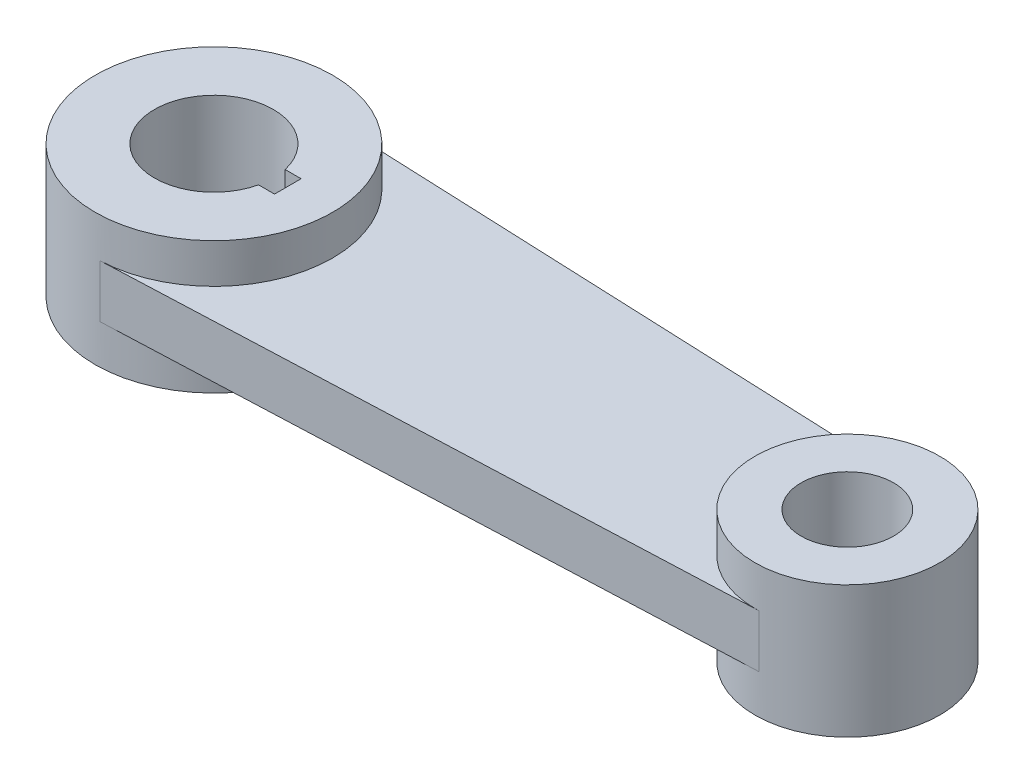
ISO-10303-21;
HEADER;
FILE_DESCRIPTION(('STEP AP214'),'2;1');
FILE_NAME('part.step','',(''),(''),'','','');
FILE_SCHEMA(('AUTOMOTIVE_DESIGN { 1 0 10303 214 1 1 1 1 }'));
ENDSEC;
DATA;
#1=APPLICATION_CONTEXT('core data for automotive mechanical design processes');
#2=APPLICATION_PROTOCOL_DEFINITION('international standard','automotive_design',2000,#1);
#3=PRODUCT_CONTEXT('',#1,'mechanical');
#4=PRODUCT('Part','Part','',(#3));
#5=PRODUCT_RELATED_PRODUCT_CATEGORY('part','',(#4));
#6=PRODUCT_DEFINITION_FORMATION('','',#4);
#7=PRODUCT_DEFINITION_CONTEXT('part definition',#1,'design');
#8=PRODUCT_DEFINITION('design','',#6,#7);
#9=PRODUCT_DEFINITION_SHAPE('','',#8);
#10=(LENGTH_UNIT() NAMED_UNIT(*) SI_UNIT(.MILLI.,.METRE.));
#11=(NAMED_UNIT(*) PLANE_ANGLE_UNIT() SI_UNIT($,.RADIAN.));
#12=(NAMED_UNIT(*) SI_UNIT($,.STERADIAN.) SOLID_ANGLE_UNIT());
#13=UNCERTAINTY_MEASURE_WITH_UNIT(LENGTH_MEASURE(1.E-05),#10,'distance_accuracy_value','');
#14=(GEOMETRIC_REPRESENTATION_CONTEXT(3) GLOBAL_UNCERTAINTY_ASSIGNED_CONTEXT((#13)) GLOBAL_UNIT_ASSIGNED_CONTEXT((#10,
#11,#12)) REPRESENTATION_CONTEXT('',''));
#15=CARTESIAN_POINT('',(0.,0.,0.));
#16=DIRECTION('',(0.,0.,1.));
#17=DIRECTION('',(1.,0.,0.));
#18=AXIS2_PLACEMENT_3D('',#15,#16,#17);
#19=CARTESIAN_POINT('',(2.34375,31.25,56.2011506638209));
#20=DIRECTION('',(-0.0416666666666667,0.,-0.999131567356817));
#21=DIRECTION('',(-0.999131567356817,0.,0.0416666666666667));
#22=AXIS2_PLACEMENT_3D('',#19,#20,#21);
#23=PLANE('',#22);
#24=DIRECTION('',(0.999131567356817,0.,-0.0416666666666667));
#25=VECTOR('',#24,1.);
#26=CARTESIAN_POINT('',(2.34375,-12.5,56.2011506638209));
#27=LINE('',#26,#25);
#28=CARTESIAN_POINT('',(2.34375,-12.5,56.2011506638209));
#29=VERTEX_POINT('',#28);
#30=CARTESIAN_POINT('',(301.822916666667,-12.5,43.7120060718607));
#31=VERTEX_POINT('',#30);
#32=EDGE_CURVE('E103',#29,#31,#27,.T.);
#33=ORIENTED_EDGE('',*,*,#32,.T.);
#34=DIRECTION('',(0.,-1.,0.));
#35=VECTOR('',#34,1.);
#36=CARTESIAN_POINT('',(301.822916666667,31.25,43.7120060718607));
#37=LINE('',#36,#35);
#38=CARTESIAN_POINT('',(301.822916666667,12.5,43.7120060718607));
#39=VERTEX_POINT('',#38);
#40=EDGE_CURVE('E44',#39,#31,#37,.T.);
#41=ORIENTED_EDGE('',*,*,#40,.F.);
#42=DIRECTION('',(0.999131567356817,0.,-0.0416666666666667));
#43=VECTOR('',#42,1.);
#44=CARTESIAN_POINT('',(2.34375,12.5,56.2011506638209));
#45=LINE('',#44,#43);
#46=CARTESIAN_POINT('',(2.34375,12.5,56.2011506638209));
#47=VERTEX_POINT('',#46);
#48=EDGE_CURVE('E135',#47,#39,#45,.T.);
#49=ORIENTED_EDGE('',*,*,#48,.F.);
#50=DIRECTION('',(0.,-1.,0.));
#51=VECTOR('',#50,1.);
#52=CARTESIAN_POINT('',(2.34375,31.25,56.2011506638209));
#53=LINE('',#52,#51);
#54=EDGE_CURVE('E11',#47,#29,#53,.T.);
#55=ORIENTED_EDGE('',*,*,#54,.T.);
#56=EDGE_LOOP('',(#33,#41,#49,#55));
#57=FACE_BOUND('',#56,.T.);
#58=ADVANCED_FACE('F36',(#57),#23,.F.);
#59=CARTESIAN_POINT('',(2.34375,31.25,-56.2011506638209));
#60=DIRECTION('',(-0.0416666666666667,0.,0.999131567356817));
#61=DIRECTION('',(0.999131567356817,0.,0.0416666666666667));
#62=AXIS2_PLACEMENT_3D('',#59,#60,#61);
#63=PLANE('',#62);
#64=DIRECTION('',(-0.999131567356817,0.,-0.0416666666666667));
#65=VECTOR('',#64,1.);
#66=CARTESIAN_POINT('',(2.34375,-12.5,-56.2011506638209));
#67=LINE('',#66,#65);
#68=CARTESIAN_POINT('',(301.822916666667,-12.5,-43.7120060718607));
#69=VERTEX_POINT('',#68);
#70=CARTESIAN_POINT('',(2.34375,-12.5,-56.2011506638209));
#71=VERTEX_POINT('',#70);
#72=EDGE_CURVE('E51',#69,#71,#67,.T.);
#73=ORIENTED_EDGE('',*,*,#72,.T.);
#74=DIRECTION('',(0.,-1.,0.));
#75=VECTOR('',#74,1.);
#76=CARTESIAN_POINT('',(2.34375,31.25,-56.2011506638209));
#77=LINE('',#76,#75);
#78=CARTESIAN_POINT('',(2.34375,12.5,-56.2011506638209));
#79=VERTEX_POINT('',#78);
#80=EDGE_CURVE('E112',#79,#71,#77,.T.);
#81=ORIENTED_EDGE('',*,*,#80,.F.);
#82=DIRECTION('',(-0.999131567356817,0.,-0.0416666666666667));
#83=VECTOR('',#82,1.);
#84=CARTESIAN_POINT('',(2.34375,12.5,-56.2011506638209));
#85=LINE('',#84,#83);
#86=CARTESIAN_POINT('',(301.822916666667,12.5,-43.7120060718607));
#87=VERTEX_POINT('',#86);
#88=EDGE_CURVE('E142',#87,#79,#85,.T.);
#89=ORIENTED_EDGE('',*,*,#88,.F.);
#90=DIRECTION('',(0.,-1.,0.));
#91=VECTOR('',#90,1.);
#92=CARTESIAN_POINT('',(301.822916666667,31.25,-43.7120060718607));
#93=LINE('',#92,#91);
#94=EDGE_CURVE('E114',#87,#69,#93,.T.);
#95=ORIENTED_EDGE('',*,*,#94,.T.);
#96=EDGE_LOOP('',(#73,#81,#89,#95));
#97=FACE_BOUND('',#96,.T.);
#98=ADVANCED_FACE('F111',(#97),#63,.F.);
#99=CARTESIAN_POINT('',(0.,-31.25,0.));
#100=DIRECTION('',(0.,1.,0.));
#101=DIRECTION('',(0.,0.,1.));
#102=AXIS2_PLACEMENT_3D('',#99,#100,#101);
#103=PLANE('',#102);
#104=DIRECTION('',(0.,0.,-1.));
#105=VECTOR('',#104,1.);
#106=CARTESIAN_POINT('',(35.,-31.25,-6.3));
#107=LINE('',#106,#105);
#108=CARTESIAN_POINT('',(35.,-31.25,6.3));
#109=VERTEX_POINT('',#108);
#110=CARTESIAN_POINT('',(35.,-31.25,-6.3));
#111=VERTEX_POINT('',#110);
#112=EDGE_CURVE('E144',#109,#111,#107,.T.);
#113=ORIENTED_EDGE('',*,*,#112,.T.);
#114=DIRECTION('',(-1.,0.,0.));
#115=VECTOR('',#114,1.);
#116=CARTESIAN_POINT('',(27.435970914112,-31.25,-6.3));
#117=LINE('',#116,#115);
#118=CARTESIAN_POINT('',(27.435970914112,-31.25,-6.3));
#119=VERTEX_POINT('',#118);
#120=EDGE_CURVE('E158',#111,#119,#117,.T.);
#121=ORIENTED_EDGE('',*,*,#120,.T.);
#122=CARTESIAN_POINT('',(0.,-31.25,0.));
#123=DIRECTION('',(0.,1.,0.));
#124=DIRECTION('',(0.,0.,1.));
#125=AXIS2_PLACEMENT_3D('',#122,#123,#124);
#126=CIRCLE('',#125,28.15);
#127=CARTESIAN_POINT('',(27.435970914112,-31.25,6.3));
#128=VERTEX_POINT('',#127);
#129=EDGE_CURVE('E161',#119,#128,#126,.T.);
#130=ORIENTED_EDGE('',*,*,#129,.T.);
#131=DIRECTION('',(1.,0.,0.));
#132=VECTOR('',#131,1.);
#133=CARTESIAN_POINT('',(27.435970914112,-31.25,6.3));
#134=LINE('',#133,#132);
#135=EDGE_CURVE('E148',#128,#109,#134,.T.);
#136=ORIENTED_EDGE('',*,*,#135,.T.);
#137=EDGE_LOOP('',(#113,#121,#130,#136));
#138=FACE_BOUND('',#137,.T.);
#139=CARTESIAN_POINT('',(0.,-31.25,0.));
#140=DIRECTION('',(0.,1.,0.));
#141=DIRECTION('',(0.,0.,1.));
#142=AXIS2_PLACEMENT_3D('',#139,#140,#141);
#143=CIRCLE('',#142,56.25);
#144=CARTESIAN_POINT('',(0.,-31.25,56.25));
#145=VERTEX_POINT('',#144);
#146=EDGE_CURVE('E179',#145,#145,#143,.T.);
#147=ORIENTED_EDGE('',*,*,#146,.F.);
#148=EDGE_LOOP('',(#147));
#149=FACE_BOUND('',#148,.T.);
#150=ADVANCED_FACE('F193',(#138,#149),#103,.F.);
#151=CARTESIAN_POINT('',(300.,-31.25,0.));
#152=DIRECTION('',(0.,1.,0.));
#153=DIRECTION('',(0.,0.,1.));
#154=AXIS2_PLACEMENT_3D('',#151,#152,#153);
#155=CIRCLE('',#154,21.9);
#156=CARTESIAN_POINT('',(300.,-31.25,21.9));
#157=VERTEX_POINT('',#156);
#158=EDGE_CURVE('E175',#157,#157,#155,.T.);
#159=ORIENTED_EDGE('',*,*,#158,.T.);
#160=EDGE_LOOP('',(#159));
#161=FACE_BOUND('',#160,.T.);
#162=CARTESIAN_POINT('',(300.,-31.25,0.));
#163=DIRECTION('',(0.,1.,0.));
#164=DIRECTION('',(0.,0.,1.));
#165=AXIS2_PLACEMENT_3D('',#162,#163,#164);
#166=CIRCLE('',#165,43.75);
#167=CARTESIAN_POINT('',(300.,-31.25,43.75));
#168=VERTEX_POINT('',#167);
#169=EDGE_CURVE('E126',#168,#168,#166,.T.);
#170=ORIENTED_EDGE('',*,*,#169,.F.);
#171=EDGE_LOOP('',(#170));
#172=FACE_BOUND('',#171,.T.);
#173=ADVANCED_FACE('F190',(#161,#172),#103,.F.);
#174=CARTESIAN_POINT('',(0.,31.25,0.));
#175=DIRECTION('',(0.,1.,0.));
#176=DIRECTION('',(0.,0.,1.));
#177=AXIS2_PLACEMENT_3D('',#174,#175,#176);
#178=PLANE('',#177);
#179=CARTESIAN_POINT('',(0.,31.25,0.));
#180=DIRECTION('',(0.,1.,0.));
#181=DIRECTION('',(0.,0.,1.));
#182=AXIS2_PLACEMENT_3D('',#179,#180,#181);
#183=CIRCLE('',#182,56.25);
#184=CARTESIAN_POINT('',(0.,31.25,56.25));
#185=VERTEX_POINT('',#184);
#186=EDGE_CURVE('E123',#185,#185,#183,.T.);
#187=ORIENTED_EDGE('',*,*,#186,.T.);
#188=EDGE_LOOP('',(#187));
#189=FACE_BOUND('',#188,.T.);
#190=DIRECTION('',(-1.,0.,0.));
#191=VECTOR('',#190,1.);
#192=CARTESIAN_POINT('',(27.435970914112,31.25,-6.3));
#193=LINE('',#192,#191);
#194=CARTESIAN_POINT('',(35.,31.25,-6.3));
#195=VERTEX_POINT('',#194);
#196=CARTESIAN_POINT('',(27.435970914112,31.25,-6.3));
#197=VERTEX_POINT('',#196);
#198=EDGE_CURVE('E147',#195,#197,#193,.T.);
#199=ORIENTED_EDGE('',*,*,#198,.F.);
#200=DIRECTION('',(0.,0.,-1.));
#201=VECTOR('',#200,1.);
#202=CARTESIAN_POINT('',(35.,31.25,-6.3));
#203=LINE('',#202,#201);
#204=CARTESIAN_POINT('',(35.,31.25,6.3));
#205=VERTEX_POINT('',#204);
#206=EDGE_CURVE('E145',#205,#195,#203,.T.);
#207=ORIENTED_EDGE('',*,*,#206,.F.);
#208=DIRECTION('',(1.,0.,0.));
#209=VECTOR('',#208,1.);
#210=CARTESIAN_POINT('',(27.435970914112,31.25,6.3));
#211=LINE('',#210,#209);
#212=CARTESIAN_POINT('',(27.435970914112,31.25,6.3));
#213=VERTEX_POINT('',#212);
#214=EDGE_CURVE('E153',#213,#205,#211,.T.);
#215=ORIENTED_EDGE('',*,*,#214,.F.);
#216=CARTESIAN_POINT('',(0.,31.25,0.));
#217=DIRECTION('',(0.,1.,0.));
#218=DIRECTION('',(0.,0.,1.));
#219=AXIS2_PLACEMENT_3D('',#216,#217,#218);
#220=CIRCLE('',#219,28.15);
#221=EDGE_CURVE('E150',#197,#213,#220,.T.);
#222=ORIENTED_EDGE('',*,*,#221,.F.);
#223=EDGE_LOOP('',(#199,#207,#215,#222));
#224=FACE_BOUND('',#223,.T.);
#225=ADVANCED_FACE('F192',(#189,#224),#178,.T.);
#226=CARTESIAN_POINT('',(300.,31.25,0.));
#227=DIRECTION('',(0.,1.,0.));
#228=DIRECTION('',(0.,0.,1.));
#229=AXIS2_PLACEMENT_3D('',#226,#227,#228);
#230=CIRCLE('',#229,43.75);
#231=CARTESIAN_POINT('',(300.,31.25,43.75));
#232=VERTEX_POINT('',#231);
#233=EDGE_CURVE('E119',#232,#232,#230,.T.);
#234=ORIENTED_EDGE('',*,*,#233,.T.);
#235=EDGE_LOOP('',(#234));
#236=FACE_BOUND('',#235,.T.);
#237=CARTESIAN_POINT('',(300.,31.25,0.));
#238=DIRECTION('',(0.,1.,0.));
#239=DIRECTION('',(0.,0.,1.));
#240=AXIS2_PLACEMENT_3D('',#237,#238,#239);
#241=CIRCLE('',#240,21.9);
#242=CARTESIAN_POINT('',(300.,31.25,21.9));
#243=VERTEX_POINT('',#242);
#244=EDGE_CURVE('E176',#243,#243,#241,.T.);
#245=ORIENTED_EDGE('',*,*,#244,.F.);
#246=EDGE_LOOP('',(#245));
#247=FACE_BOUND('',#246,.T.);
#248=ADVANCED_FACE('F200',(#236,#247),#178,.T.);
#249=CARTESIAN_POINT('',(0.,31.25,0.));
#250=DIRECTION('',(0.,-1.,0.));
#251=DIRECTION('',(0.,0.,-1.));
#252=AXIS2_PLACEMENT_3D('',#249,#250,#251);
#253=CYLINDRICAL_SURFACE('',#252,56.25);
#254=ORIENTED_EDGE('',*,*,#146,.T.);
#255=EDGE_LOOP('',(#254));
#256=FACE_BOUND('',#255,.T.);
#257=ORIENTED_EDGE('',*,*,#54,.F.);
#258=CARTESIAN_POINT('',(0.,12.5,0.));
#259=DIRECTION('',(0.,-1.,0.));
#260=DIRECTION('',(0.,0.,1.));
#261=AXIS2_PLACEMENT_3D('',#258,#259,#260);
#262=CIRCLE('',#261,56.25);
#263=EDGE_CURVE('E118',#79,#47,#262,.T.);
#264=ORIENTED_EDGE('',*,*,#263,.F.);
#265=ORIENTED_EDGE('',*,*,#80,.T.);
#266=CARTESIAN_POINT('',(0.,-12.5,0.));
#267=DIRECTION('',(0.,-1.,0.));
#268=DIRECTION('',(0.,0.,1.));
#269=AXIS2_PLACEMENT_3D('',#266,#267,#268);
#270=CIRCLE('',#269,56.25);
#271=EDGE_CURVE('E100',#71,#29,#270,.T.);
#272=ORIENTED_EDGE('',*,*,#271,.T.);
#273=EDGE_LOOP('',(#257,#264,#265,#272));
#274=FACE_BOUND('',#273,.T.);
#275=ORIENTED_EDGE('',*,*,#186,.F.);
#276=EDGE_LOOP('',(#275));
#277=FACE_BOUND('',#276,.T.);
#278=ADVANCED_FACE('F38',(#256,#274,#277),#253,.T.);
#279=CARTESIAN_POINT('',(300.,31.25,0.));
#280=DIRECTION('',(0.,-1.,0.));
#281=DIRECTION('',(0.,0.,-1.));
#282=AXIS2_PLACEMENT_3D('',#279,#280,#281);
#283=CYLINDRICAL_SURFACE('',#282,43.75);
#284=ORIENTED_EDGE('',*,*,#169,.T.);
#285=EDGE_LOOP('',(#284));
#286=FACE_BOUND('',#285,.T.);
#287=CARTESIAN_POINT('',(300.,12.5,0.));
#288=DIRECTION('',(0.,-1.,0.));
#289=DIRECTION('',(0.,0.,1.));
#290=AXIS2_PLACEMENT_3D('',#287,#288,#289);
#291=CIRCLE('',#290,43.75);
#292=EDGE_CURVE('E59',#39,#87,#291,.T.);
#293=ORIENTED_EDGE('',*,*,#292,.F.);
#294=ORIENTED_EDGE('',*,*,#40,.T.);
#295=CARTESIAN_POINT('',(300.,-12.5,0.));
#296=DIRECTION('',(0.,-1.,0.));
#297=DIRECTION('',(0.,0.,1.));
#298=AXIS2_PLACEMENT_3D('',#295,#296,#297);
#299=CIRCLE('',#298,43.75);
#300=EDGE_CURVE('E115',#31,#69,#299,.T.);
#301=ORIENTED_EDGE('',*,*,#300,.T.);
#302=ORIENTED_EDGE('',*,*,#94,.F.);
#303=EDGE_LOOP('',(#293,#294,#301,#302));
#304=FACE_BOUND('',#303,.T.);
#305=ORIENTED_EDGE('',*,*,#233,.F.);
#306=EDGE_LOOP('',(#305));
#307=FACE_BOUND('',#306,.T.);
#308=ADVANCED_FACE('F131',(#286,#304,#307),#283,.T.);
#309=CARTESIAN_POINT('',(300.,31.25,0.));
#310=DIRECTION('',(0.,-1.,0.));
#311=DIRECTION('',(0.,0.,-1.));
#312=AXIS2_PLACEMENT_3D('',#309,#310,#311);
#313=CYLINDRICAL_SURFACE('',#312,21.9);
#314=ORIENTED_EDGE('',*,*,#244,.T.);
#315=EDGE_LOOP('',(#314));
#316=FACE_BOUND('',#315,.T.);
#317=ORIENTED_EDGE('',*,*,#158,.F.);
#318=EDGE_LOOP('',(#317));
#319=FACE_BOUND('',#318,.T.);
#320=ADVANCED_FACE('F211',(#316,#319),#313,.F.);
#321=CARTESIAN_POINT('',(35.,31.25,-6.3));
#322=DIRECTION('',(-1.,0.,0.));
#323=DIRECTION('',(0.,0.,1.));
#324=AXIS2_PLACEMENT_3D('',#321,#322,#323);
#325=PLANE('',#324);
#326=ORIENTED_EDGE('',*,*,#112,.F.);
#327=DIRECTION('',(0.,-1.,0.));
#328=VECTOR('',#327,1.);
#329=CARTESIAN_POINT('',(35.,31.25,6.3));
#330=LINE('',#329,#328);
#331=EDGE_CURVE('E155',#205,#109,#330,.T.);
#332=ORIENTED_EDGE('',*,*,#331,.F.);
#333=ORIENTED_EDGE('',*,*,#206,.T.);
#334=DIRECTION('',(0.,-1.,0.));
#335=VECTOR('',#334,1.);
#336=CARTESIAN_POINT('',(35.,31.25,-6.3));
#337=LINE('',#336,#335);
#338=EDGE_CURVE('E172',#195,#111,#337,.T.);
#339=ORIENTED_EDGE('',*,*,#338,.T.);
#340=EDGE_LOOP('',(#326,#332,#333,#339));
#341=FACE_BOUND('',#340,.T.);
#342=ADVANCED_FACE('F216',(#341),#325,.T.);
#343=CARTESIAN_POINT('',(27.435970914112,31.25,-6.3));
#344=DIRECTION('',(0.,0.,1.));
#345=DIRECTION('',(1.,0.,0.));
#346=AXIS2_PLACEMENT_3D('',#343,#344,#345);
#347=PLANE('',#346);
#348=ORIENTED_EDGE('',*,*,#120,.F.);
#349=ORIENTED_EDGE('',*,*,#338,.F.);
#350=ORIENTED_EDGE('',*,*,#198,.T.);
#351=DIRECTION('',(0.,-1.,0.));
#352=VECTOR('',#351,1.);
#353=CARTESIAN_POINT('',(27.435970914112,31.25,-6.3));
#354=LINE('',#353,#352);
#355=EDGE_CURVE('E170',#197,#119,#354,.T.);
#356=ORIENTED_EDGE('',*,*,#355,.T.);
#357=EDGE_LOOP('',(#348,#349,#350,#356));
#358=FACE_BOUND('',#357,.T.);
#359=ADVANCED_FACE('F229',(#358),#347,.T.);
#360=CARTESIAN_POINT('',(0.,31.25,0.));
#361=DIRECTION('',(0.,-1.,0.));
#362=DIRECTION('',(0.,0.,-1.));
#363=AXIS2_PLACEMENT_3D('',#360,#361,#362);
#364=CYLINDRICAL_SURFACE('',#363,28.15);
#365=ORIENTED_EDGE('',*,*,#129,.F.);
#366=ORIENTED_EDGE('',*,*,#355,.F.);
#367=ORIENTED_EDGE('',*,*,#221,.T.);
#368=DIRECTION('',(0.,-1.,0.));
#369=VECTOR('',#368,1.);
#370=CARTESIAN_POINT('',(27.435970914112,31.25,6.3));
#371=LINE('',#370,#369);
#372=EDGE_CURVE('E168',#213,#128,#371,.T.);
#373=ORIENTED_EDGE('',*,*,#372,.T.);
#374=EDGE_LOOP('',(#365,#366,#367,#373));
#375=FACE_BOUND('',#374,.T.);
#376=ADVANCED_FACE('F233',(#375),#364,.F.);
#377=CARTESIAN_POINT('',(27.435970914112,31.25,6.3));
#378=DIRECTION('',(0.,0.,-1.));
#379=DIRECTION('',(-1.,0.,0.));
#380=AXIS2_PLACEMENT_3D('',#377,#378,#379);
#381=PLANE('',#380);
#382=ORIENTED_EDGE('',*,*,#135,.F.);
#383=ORIENTED_EDGE('',*,*,#372,.F.);
#384=ORIENTED_EDGE('',*,*,#214,.T.);
#385=ORIENTED_EDGE('',*,*,#331,.T.);
#386=EDGE_LOOP('',(#382,#383,#384,#385));
#387=FACE_BOUND('',#386,.T.);
#388=ADVANCED_FACE('F237',(#387),#381,.T.);
#389=CARTESIAN_POINT('',(0.,12.5,0.));
#390=DIRECTION('',(0.,1.,0.));
#391=DIRECTION('',(0.,0.,1.));
#392=AXIS2_PLACEMENT_3D('',#389,#390,#391);
#393=PLANE('',#392);
#394=ORIENTED_EDGE('',*,*,#263,.T.);
#395=ORIENTED_EDGE('',*,*,#48,.T.);
#396=ORIENTED_EDGE('',*,*,#292,.T.);
#397=ORIENTED_EDGE('',*,*,#88,.T.);
#398=EDGE_LOOP('',(#394,#395,#396,#397));
#399=FACE_BOUND('',#398,.T.);
#400=ADVANCED_FACE('F241',(#399),#393,.T.);
#401=CARTESIAN_POINT('',(0.,-12.5,0.));
#402=DIRECTION('',(0.,-1.,0.));
#403=DIRECTION('',(0.,0.,1.));
#404=AXIS2_PLACEMENT_3D('',#401,#402,#403);
#405=PLANE('',#404);
#406=ORIENTED_EDGE('',*,*,#271,.F.);
#407=ORIENTED_EDGE('',*,*,#72,.F.);
#408=ORIENTED_EDGE('',*,*,#300,.F.);
#409=ORIENTED_EDGE('',*,*,#32,.F.);
#410=EDGE_LOOP('',(#406,#407,#408,#409));
#411=FACE_BOUND('',#410,.T.);
#412=ADVANCED_FACE('F101',(#411),#405,.T.);
#413=CLOSED_SHELL('',(#58,#98,#150,#173,#225,#248,#278,#308,#320,#342,#359,#376,#388,#400,#412));
#414=MANIFOLD_SOLID_BREP('B2',#413);
#415=ADVANCED_BREP_SHAPE_REPRESENTATION('',(#18,#414),#14);
#416=SHAPE_DEFINITION_REPRESENTATION(#9,#415);
ENDSEC;
END-ISO-10303-21;
